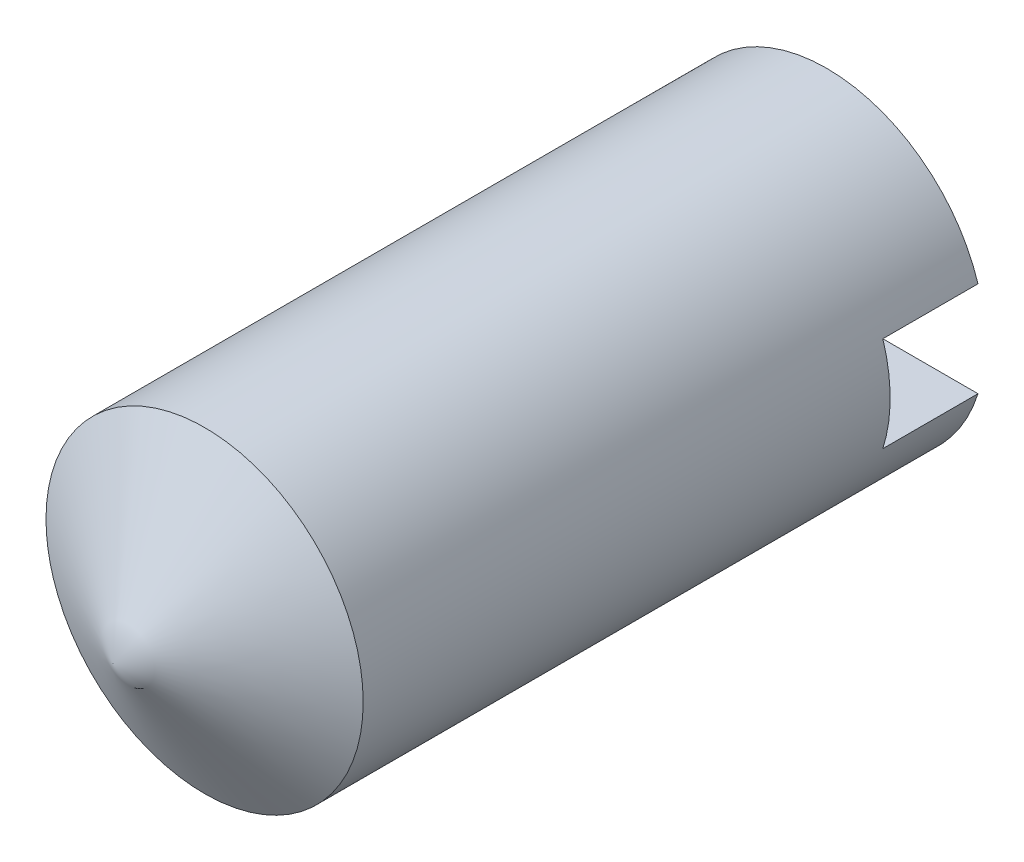
ISO-10303-21;
HEADER;
FILE_DESCRIPTION(('STEP AP214'),'2;1');
FILE_NAME('part.step','',(''),(''),'','','');
FILE_SCHEMA(('AUTOMOTIVE_DESIGN { 1 0 10303 214 1 1 1 1 }'));
ENDSEC;
DATA;
#1=APPLICATION_CONTEXT('core data for automotive mechanical design processes');
#2=APPLICATION_PROTOCOL_DEFINITION('international standard','automotive_design',2000,#1);
#3=PRODUCT_CONTEXT('',#1,'mechanical');
#4=PRODUCT('Part','Part','',(#3));
#5=PRODUCT_RELATED_PRODUCT_CATEGORY('part','',(#4));
#6=PRODUCT_DEFINITION_FORMATION('','',#4);
#7=PRODUCT_DEFINITION_CONTEXT('part definition',#1,'design');
#8=PRODUCT_DEFINITION('design','',#6,#7);
#9=PRODUCT_DEFINITION_SHAPE('','',#8);
#10=(LENGTH_UNIT() NAMED_UNIT(*) SI_UNIT(.MILLI.,.METRE.));
#11=(NAMED_UNIT(*) PLANE_ANGLE_UNIT() SI_UNIT($,.RADIAN.));
#12=(NAMED_UNIT(*) SI_UNIT($,.STERADIAN.) SOLID_ANGLE_UNIT());
#13=UNCERTAINTY_MEASURE_WITH_UNIT(LENGTH_MEASURE(1.E-05),#10,'distance_accuracy_value','');
#14=(GEOMETRIC_REPRESENTATION_CONTEXT(3) GLOBAL_UNCERTAINTY_ASSIGNED_CONTEXT((#13)) GLOBAL_UNIT_ASSIGNED_CONTEXT((#10,
#11,#12)) REPRESENTATION_CONTEXT('',''));
#15=CARTESIAN_POINT('',(0.,0.,0.));
#16=DIRECTION('',(0.,0.,1.));
#17=DIRECTION('',(1.,0.,0.));
#18=AXIS2_PLACEMENT_3D('',#15,#16,#17);
#19=CARTESIAN_POINT('',(0.,0.,4.5));
#20=DIRECTION('',(0.,0.,-1.));
#21=DIRECTION('',(-1.,0.,0.));
#22=AXIS2_PLACEMENT_3D('',#19,#20,#21);
#23=CYLINDRICAL_SURFACE('',#22,1.);
#24=CARTESIAN_POINT('',(0.,0.,3.92264973081037));
#25=DIRECTION('',(0.,0.,1.));
#26=DIRECTION('',(1.,0.,0.));
#27=AXIS2_PLACEMENT_3D('',#24,#25,#26);
#28=CIRCLE('',#27,1.);
#29=CARTESIAN_POINT('',(1.,0.,3.92264973081037));
#30=VERTEX_POINT('',#29);
#31=EDGE_CURVE('E11',#30,#30,#28,.F.);
#32=ORIENTED_EDGE('',*,*,#31,.T.);
#33=EDGE_LOOP('',(#32));
#34=FACE_BOUND('',#33,.T.);
#35=DIRECTION('',(0.,0.,-1.));
#36=VECTOR('',#35,1.);
#37=CARTESIAN_POINT('',(-0.953939201416946,-0.3,4.5));
#38=LINE('',#37,#36);
#39=CARTESIAN_POINT('',(-0.953939201416946,-0.3,0.));
#40=VERTEX_POINT('',#39);
#41=CARTESIAN_POINT('',(-0.953939201416946,-0.3,0.6));
#42=VERTEX_POINT('',#41);
#43=EDGE_CURVE('E95',#40,#42,#38,.F.);
#44=ORIENTED_EDGE('',*,*,#43,.F.);
#45=CARTESIAN_POINT('',(0.,0.,0.));
#46=DIRECTION('',(0.,0.,1.));
#47=DIRECTION('',(1.,0.,0.));
#48=AXIS2_PLACEMENT_3D('',#45,#46,#47);
#49=CIRCLE('',#48,1.);
#50=CARTESIAN_POINT('',(0.953939201416946,-0.299999999999999,0.));
#51=VERTEX_POINT('',#50);
#52=EDGE_CURVE('E98',#40,#51,#49,.T.);
#53=ORIENTED_EDGE('',*,*,#52,.T.);
#54=DIRECTION('',(0.,0.,-1.));
#55=VECTOR('',#54,1.);
#56=CARTESIAN_POINT('',(0.953939201416946,-0.299999999999999,4.5));
#57=LINE('',#56,#55);
#58=CARTESIAN_POINT('',(0.953939201416946,-0.299999999999999,0.6));
#59=VERTEX_POINT('',#58);
#60=EDGE_CURVE('E100',#59,#51,#57,.T.);
#61=ORIENTED_EDGE('',*,*,#60,.F.);
#62=CARTESIAN_POINT('',(0.,0.,0.6));
#63=DIRECTION('',(0.,0.,1.));
#64=DIRECTION('',(1.,0.,0.));
#65=AXIS2_PLACEMENT_3D('',#62,#63,#64);
#66=CIRCLE('',#65,1.);
#67=CARTESIAN_POINT('',(0.953939201416946,0.3,0.6));
#68=VERTEX_POINT('',#67);
#69=EDGE_CURVE('E49',#59,#68,#66,.T.);
#70=ORIENTED_EDGE('',*,*,#69,.T.);
#71=DIRECTION('',(0.,0.,-1.));
#72=VECTOR('',#71,1.);
#73=CARTESIAN_POINT('',(0.953939201416946,0.3,4.5));
#74=LINE('',#73,#72);
#75=CARTESIAN_POINT('',(0.953939201416946,0.3,0.));
#76=VERTEX_POINT('',#75);
#77=EDGE_CURVE('E112',#76,#68,#74,.F.);
#78=ORIENTED_EDGE('',*,*,#77,.F.);
#79=CARTESIAN_POINT('',(-0.953939201416946,0.3,0.));
#80=VERTEX_POINT('',#79);
#81=EDGE_CURVE('E104',#76,#80,#49,.T.);
#82=ORIENTED_EDGE('',*,*,#81,.T.);
#83=DIRECTION('',(0.,0.,-1.));
#84=VECTOR('',#83,1.);
#85=CARTESIAN_POINT('',(-0.953939201416946,0.3,4.5));
#86=LINE('',#85,#84);
#87=CARTESIAN_POINT('',(-0.953939201416946,0.3,0.6));
#88=VERTEX_POINT('',#87);
#89=EDGE_CURVE('E41',#88,#80,#86,.T.);
#90=ORIENTED_EDGE('',*,*,#89,.F.);
#91=EDGE_CURVE('E34',#88,#42,#66,.T.);
#92=ORIENTED_EDGE('',*,*,#91,.T.);
#93=EDGE_LOOP('',(#44,#53,#61,#70,#78,#82,#90,#92));
#94=FACE_BOUND('',#93,.T.);
#95=ADVANCED_FACE('F27',(#34,#94),#23,.T.);
#96=CARTESIAN_POINT('',(0.,0.,0.));
#97=DIRECTION('',(0.,0.,1.));
#98=DIRECTION('',(1.,0.,0.));
#99=AXIS2_PLACEMENT_3D('',#96,#97,#98);
#100=PLANE('',#99);
#101=DIRECTION('',(-1.,0.,0.));
#102=VECTOR('',#101,1.);
#103=CARTESIAN_POINT('',(0.,-0.299999999999999,0.));
#104=LINE('',#103,#102);
#105=EDGE_CURVE('E103',#51,#40,#104,.T.);
#106=ORIENTED_EDGE('',*,*,#105,.F.);
#107=ORIENTED_EDGE('',*,*,#52,.F.);
#108=EDGE_LOOP('',(#106,#107));
#109=FACE_BOUND('',#108,.T.);
#110=ADVANCED_FACE('F84',(#109),#100,.F.);
#111=DIRECTION('',(1.,0.,0.));
#112=VECTOR('',#111,1.);
#113=CARTESIAN_POINT('',(0.,0.3,0.));
#114=LINE('',#113,#112);
#115=EDGE_CURVE('E107',#80,#76,#114,.T.);
#116=ORIENTED_EDGE('',*,*,#115,.F.);
#117=ORIENTED_EDGE('',*,*,#81,.F.);
#118=EDGE_LOOP('',(#116,#117));
#119=FACE_BOUND('',#118,.T.);
#120=ADVANCED_FACE('F89',(#119),#100,.F.);
#121=CARTESIAN_POINT('',(-1.46068115440089,-0.3,0.6));
#122=DIRECTION('',(0.,0.,1.));
#123=DIRECTION('',(1.,0.,0.));
#124=AXIS2_PLACEMENT_3D('',#121,#122,#123);
#125=PLANE('',#124);
#126=DIRECTION('',(-1.,0.,0.));
#127=VECTOR('',#126,1.);
#128=CARTESIAN_POINT('',(1.52025854965165,0.3,0.6));
#129=LINE('',#128,#127);
#130=EDGE_CURVE('E115',#68,#88,#129,.T.);
#131=ORIENTED_EDGE('',*,*,#130,.F.);
#132=ORIENTED_EDGE('',*,*,#69,.F.);
#133=DIRECTION('',(1.,0.,0.));
#134=VECTOR('',#133,1.);
#135=CARTESIAN_POINT('',(-1.46068115440089,-0.3,0.6));
#136=LINE('',#135,#134);
#137=EDGE_CURVE('E114',#42,#59,#136,.T.);
#138=ORIENTED_EDGE('',*,*,#137,.F.);
#139=ORIENTED_EDGE('',*,*,#91,.F.);
#140=EDGE_LOOP('',(#131,#132,#138,#139));
#141=FACE_BOUND('',#140,.T.);
#142=ADVANCED_FACE('F120',(#141),#125,.F.);
#143=CARTESIAN_POINT('',(-1.46068115440089,-0.3,0.6));
#144=DIRECTION('',(0.,1.,0.));
#145=DIRECTION('',(-1.,0.,0.));
#146=AXIS2_PLACEMENT_3D('',#143,#144,#145);
#147=PLANE('',#146);
#148=ORIENTED_EDGE('',*,*,#60,.T.);
#149=ORIENTED_EDGE('',*,*,#105,.T.);
#150=ORIENTED_EDGE('',*,*,#43,.T.);
#151=ORIENTED_EDGE('',*,*,#137,.T.);
#152=EDGE_LOOP('',(#148,#149,#150,#151));
#153=FACE_BOUND('',#152,.T.);
#154=ADVANCED_FACE('F80',(#153),#147,.T.);
#155=CARTESIAN_POINT('',(1.52025854965165,0.3,0.6));
#156=DIRECTION('',(0.,-1.,0.));
#157=DIRECTION('',(1.,0.,0.));
#158=AXIS2_PLACEMENT_3D('',#155,#156,#157);
#159=PLANE('',#158);
#160=ORIENTED_EDGE('',*,*,#89,.T.);
#161=ORIENTED_EDGE('',*,*,#115,.T.);
#162=ORIENTED_EDGE('',*,*,#77,.T.);
#163=ORIENTED_EDGE('',*,*,#130,.T.);
#164=EDGE_LOOP('',(#160,#161,#162,#163));
#165=FACE_BOUND('',#164,.T.);
#166=ADVANCED_FACE('F73',(#165),#159,.T.);
#167=CARTESIAN_POINT('',(0.,0.,3.92264973081037));
#168=DIRECTION('',(0.,0.,-1.));
#169=DIRECTION('',(-1.,0.,0.));
#170=AXIS2_PLACEMENT_3D('',#167,#168,#169);
#171=CONICAL_SURFACE('',#170,1.00000000000001,1.0471975511966);
#172=ORIENTED_EDGE('',*,*,#31,.F.);
#173=EDGE_LOOP('',(#172));
#174=FACE_BOUND('',#173,.T.);
#175=CARTESIAN_POINT('',(0.,0.,4.5));
#176=VERTEX_POINT('',#175);
#177=VERTEX_LOOP('',#176);
#178=FACE_BOUND('',#177,.T.);
#179=ADVANCED_FACE('F71',(#174,#178),#171,.T.);
#180=CLOSED_SHELL('',(#95,#110,#120,#142,#154,#166,#179));
#181=MANIFOLD_SOLID_BREP('B2',#180);
#182=ADVANCED_BREP_SHAPE_REPRESENTATION('',(#18,#181),#14);
#183=SHAPE_DEFINITION_REPRESENTATION(#9,#182);
ENDSEC;
END-ISO-10303-21;
